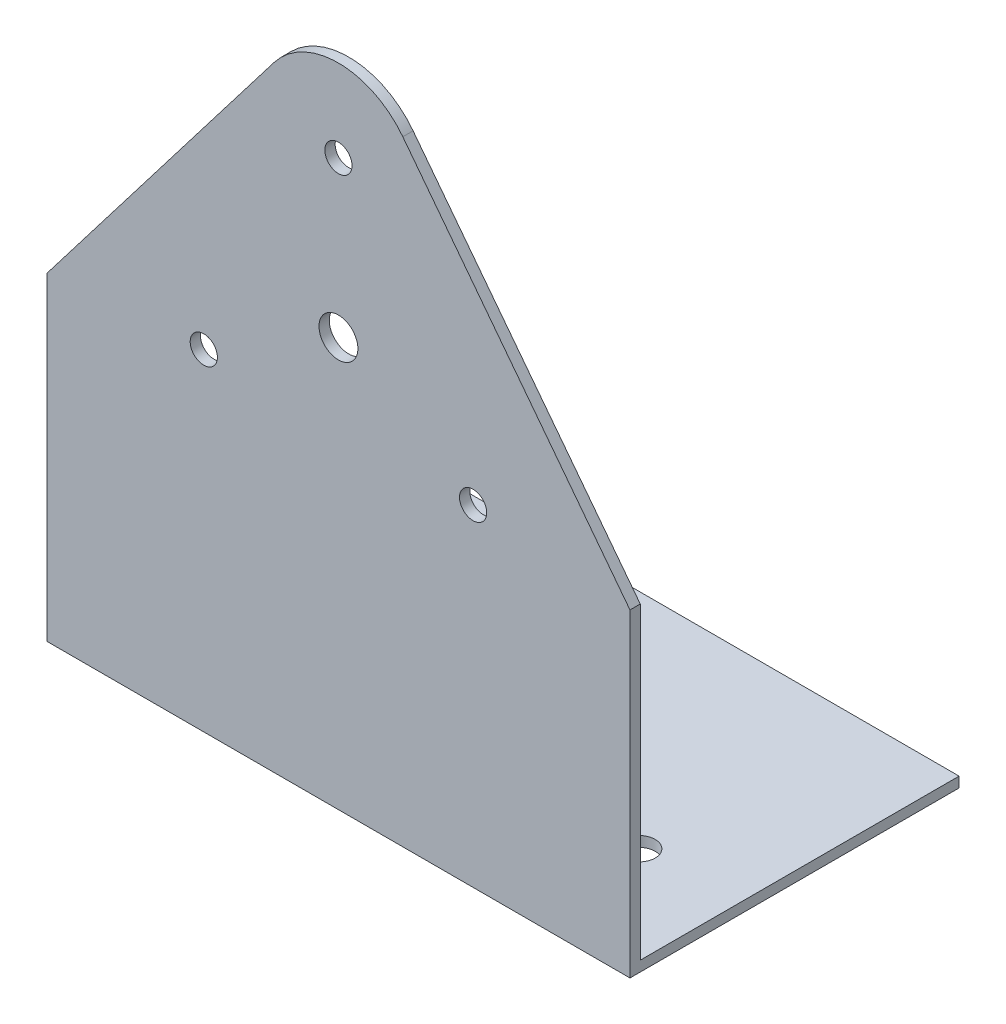
ISO-10303-21;
HEADER;
FILE_DESCRIPTION(('STEP AP214'),'2;1');
FILE_NAME('part.step','',(''),(''),'','','');
FILE_SCHEMA(('AUTOMOTIVE_DESIGN { 1 0 10303 214 1 1 1 1 }'));
ENDSEC;
DATA;
#1=APPLICATION_CONTEXT('core data for automotive mechanical design processes');
#2=APPLICATION_PROTOCOL_DEFINITION('international standard','automotive_design',2000,#1);
#3=PRODUCT_CONTEXT('',#1,'mechanical');
#4=PRODUCT('Part','Part','',(#3));
#5=PRODUCT_RELATED_PRODUCT_CATEGORY('part','',(#4));
#6=PRODUCT_DEFINITION_FORMATION('','',#4);
#7=PRODUCT_DEFINITION_CONTEXT('part definition',#1,'design');
#8=PRODUCT_DEFINITION('design','',#6,#7);
#9=PRODUCT_DEFINITION_SHAPE('','',#8);
#10=(LENGTH_UNIT() NAMED_UNIT(*) SI_UNIT(.MILLI.,.METRE.));
#11=(NAMED_UNIT(*) PLANE_ANGLE_UNIT() SI_UNIT($,.RADIAN.));
#12=(NAMED_UNIT(*) SI_UNIT($,.STERADIAN.) SOLID_ANGLE_UNIT());
#13=UNCERTAINTY_MEASURE_WITH_UNIT(LENGTH_MEASURE(1.E-05),#10,'distance_accuracy_value','');
#14=(GEOMETRIC_REPRESENTATION_CONTEXT(3) GLOBAL_UNCERTAINTY_ASSIGNED_CONTEXT((#13)) GLOBAL_UNIT_ASSIGNED_CONTEXT((#10,
#11,#12)) REPRESENTATION_CONTEXT('',''));
#15=CARTESIAN_POINT('',(0.,0.,0.));
#16=DIRECTION('',(0.,0.,1.));
#17=DIRECTION('',(1.,0.,0.));
#18=AXIS2_PLACEMENT_3D('',#15,#16,#17);
#19=CARTESIAN_POINT('',(90.,0.,0.));
#20=DIRECTION('',(0.,1.,0.));
#21=DIRECTION('',(0.,0.,1.));
#22=AXIS2_PLACEMENT_3D('',#19,#20,#21);
#23=PLANE('',#22);
#24=CARTESIAN_POINT('',(15.,0.,-16.3875));
#25=DIRECTION('',(0.,-1.,0.));
#26=DIRECTION('',(0.,0.,-1.));
#27=AXIS2_PLACEMENT_3D('',#24,#25,#26);
#28=CIRCLE('',#27,2.5);
#29=CARTESIAN_POINT('',(15.,0.,-18.8875));
#30=VERTEX_POINT('',#29);
#31=EDGE_CURVE('E147',#30,#30,#28,.T.);
#32=ORIENTED_EDGE('',*,*,#31,.F.);
#33=EDGE_LOOP('',(#32));
#34=FACE_BOUND('',#33,.T.);
#35=CARTESIAN_POINT('',(75.,0.,-16.3875));
#36=DIRECTION('',(0.,-1.,0.));
#37=DIRECTION('',(0.,0.,-1.));
#38=AXIS2_PLACEMENT_3D('',#35,#36,#37);
#39=CIRCLE('',#38,2.50000000000001);
#40=CARTESIAN_POINT('',(75.,0.,-18.8875));
#41=VERTEX_POINT('',#40);
#42=EDGE_CURVE('E153',#41,#41,#39,.T.);
#43=ORIENTED_EDGE('',*,*,#42,.F.);
#44=EDGE_LOOP('',(#43));
#45=FACE_BOUND('',#44,.T.);
#46=DIRECTION('',(0.,0.,-1.));
#47=VECTOR('',#46,1.);
#48=CARTESIAN_POINT('',(0.,0.,0.));
#49=LINE('',#48,#47);
#50=CARTESIAN_POINT('',(0.,0.,0.));
#51=VERTEX_POINT('',#50);
#52=CARTESIAN_POINT('',(0.,0.,-50.8));
#53=VERTEX_POINT('',#52);
#54=EDGE_CURVE('E128',#51,#53,#49,.T.);
#55=ORIENTED_EDGE('',*,*,#54,.T.);
#56=DIRECTION('',(-1.,0.,0.));
#57=VECTOR('',#56,1.);
#58=CARTESIAN_POINT('',(90.,0.,-50.8));
#59=LINE('',#58,#57);
#60=CARTESIAN_POINT('',(90.,0.,-50.8));
#61=VERTEX_POINT('',#60);
#62=EDGE_CURVE('E117',#61,#53,#59,.T.);
#63=ORIENTED_EDGE('',*,*,#62,.F.);
#64=DIRECTION('',(0.,0.,-1.));
#65=VECTOR('',#64,1.);
#66=CARTESIAN_POINT('',(90.,0.,0.));
#67=LINE('',#66,#65);
#68=CARTESIAN_POINT('',(90.,0.,0.));
#69=VERTEX_POINT('',#68);
#70=EDGE_CURVE('E129',#69,#61,#67,.T.);
#71=ORIENTED_EDGE('',*,*,#70,.F.);
#72=DIRECTION('',(-1.,0.,0.));
#73=VECTOR('',#72,1.);
#74=CARTESIAN_POINT('',(90.,0.,0.));
#75=LINE('',#74,#73);
#76=EDGE_CURVE('E137',#69,#51,#75,.T.);
#77=ORIENTED_EDGE('',*,*,#76,.T.);
#78=EDGE_LOOP('',(#55,#63,#71,#77));
#79=FACE_BOUND('',#78,.T.);
#80=ADVANCED_FACE('F36',(#34,#45,#79),#23,.F.);
#81=CARTESIAN_POINT('',(90.,0.,-50.8));
#82=DIRECTION('',(0.,0.,1.));
#83=DIRECTION('',(1.,0.,0.));
#84=AXIS2_PLACEMENT_3D('',#81,#82,#83);
#85=PLANE('',#84);
#86=DIRECTION('',(0.,1.,0.));
#87=VECTOR('',#86,1.);
#88=CARTESIAN_POINT('',(0.,0.,-50.8));
#89=LINE('',#88,#87);
#90=CARTESIAN_POINT('',(0.,1.5875,-50.8));
#91=VERTEX_POINT('',#90);
#92=EDGE_CURVE('E204',#53,#91,#89,.T.);
#93=ORIENTED_EDGE('',*,*,#92,.T.);
#94=DIRECTION('',(-1.,0.,0.));
#95=VECTOR('',#94,1.);
#96=CARTESIAN_POINT('',(90.,1.5875,-50.8));
#97=LINE('',#96,#95);
#98=CARTESIAN_POINT('',(90.,1.5875,-50.8));
#99=VERTEX_POINT('',#98);
#100=EDGE_CURVE('E142',#99,#91,#97,.T.);
#101=ORIENTED_EDGE('',*,*,#100,.F.);
#102=DIRECTION('',(0.,1.,0.));
#103=VECTOR('',#102,1.);
#104=CARTESIAN_POINT('',(90.,0.,-50.8));
#105=LINE('',#104,#103);
#106=EDGE_CURVE('E91',#61,#99,#105,.T.);
#107=ORIENTED_EDGE('',*,*,#106,.F.);
#108=ORIENTED_EDGE('',*,*,#62,.T.);
#109=EDGE_LOOP('',(#93,#101,#107,#108));
#110=FACE_BOUND('',#109,.T.);
#111=ADVANCED_FACE('F216',(#110),#85,.F.);
#112=CARTESIAN_POINT('',(90.,1.5875,-1.5875));
#113=DIRECTION('',(0.,-1.,0.));
#114=DIRECTION('',(0.,0.,-1.));
#115=AXIS2_PLACEMENT_3D('',#112,#113,#114);
#116=PLANE('',#115);
#117=CARTESIAN_POINT('',(15.,1.58750000000001,-16.3875));
#118=DIRECTION('',(0.,-1.,0.));
#119=DIRECTION('',(0.,0.,-1.));
#120=AXIS2_PLACEMENT_3D('',#117,#118,#119);
#121=CIRCLE('',#120,2.5);
#122=CARTESIAN_POINT('',(15.,1.58750000000001,-18.8875));
#123=VERTEX_POINT('',#122);
#124=EDGE_CURVE('E39',#123,#123,#121,.T.);
#125=ORIENTED_EDGE('',*,*,#124,.T.);
#126=EDGE_LOOP('',(#125));
#127=FACE_BOUND('',#126,.T.);
#128=CARTESIAN_POINT('',(75.,1.58750000000001,-16.3875));
#129=DIRECTION('',(0.,-1.,0.));
#130=DIRECTION('',(0.,0.,-1.));
#131=AXIS2_PLACEMENT_3D('',#128,#129,#130);
#132=CIRCLE('',#131,2.50000000000001);
#133=CARTESIAN_POINT('',(75.,1.58750000000001,-18.8875));
#134=VERTEX_POINT('',#133);
#135=EDGE_CURVE('E145',#134,#134,#132,.T.);
#136=ORIENTED_EDGE('',*,*,#135,.T.);
#137=EDGE_LOOP('',(#136));
#138=FACE_BOUND('',#137,.T.);
#139=DIRECTION('',(0.,0.,1.));
#140=VECTOR('',#139,1.);
#141=CARTESIAN_POINT('',(0.,1.5875,-1.5875));
#142=LINE('',#141,#140);
#143=CARTESIAN_POINT('',(0.,1.5875,-1.5875));
#144=VERTEX_POINT('',#143);
#145=EDGE_CURVE('E133',#91,#144,#142,.T.);
#146=ORIENTED_EDGE('',*,*,#145,.T.);
#147=DIRECTION('',(-1.,0.,0.));
#148=VECTOR('',#147,1.);
#149=CARTESIAN_POINT('',(90.,1.5875,-1.5875));
#150=LINE('',#149,#148);
#151=CARTESIAN_POINT('',(90.,1.5875,-1.5875));
#152=VERTEX_POINT('',#151);
#153=EDGE_CURVE('E139',#152,#144,#150,.T.);
#154=ORIENTED_EDGE('',*,*,#153,.F.);
#155=DIRECTION('',(0.,0.,1.));
#156=VECTOR('',#155,1.);
#157=CARTESIAN_POINT('',(90.,1.5875,-1.5875));
#158=LINE('',#157,#156);
#159=EDGE_CURVE('E197',#99,#152,#158,.T.);
#160=ORIENTED_EDGE('',*,*,#159,.F.);
#161=ORIENTED_EDGE('',*,*,#100,.T.);
#162=EDGE_LOOP('',(#146,#154,#160,#161));
#163=FACE_BOUND('',#162,.T.);
#164=ADVANCED_FACE('F208',(#127,#138,#163),#116,.F.);
#165=CARTESIAN_POINT('',(90.,1.5875,-1.5875));
#166=DIRECTION('',(0.,0.,1.));
#167=DIRECTION('',(0.,-1.,0.));
#168=AXIS2_PLACEMENT_3D('',#165,#166,#167);
#169=PLANE('',#168);
#170=CARTESIAN_POINT('',(45.,87.1212211943911,-1.5875));
#171=DIRECTION('',(0.,0.,1.));
#172=DIRECTION('',(0.,-1.,0.));
#173=AXIS2_PLACEMENT_3D('',#170,#171,#172);
#174=CIRCLE('',#173,2.1);
#175=CARTESIAN_POINT('',(45.,85.0212211943911,-1.5875));
#176=VERTEX_POINT('',#175);
#177=EDGE_CURVE('E123',#176,#176,#174,.T.);
#178=ORIENTED_EDGE('',*,*,#177,.T.);
#179=EDGE_LOOP('',(#178));
#180=FACE_BOUND('',#179,.T.);
#181=CARTESIAN_POINT('',(45.,63.1212211943911,-1.5875));
#182=DIRECTION('',(0.,0.,1.));
#183=DIRECTION('',(0.,-1.,0.));
#184=AXIS2_PLACEMENT_3D('',#181,#182,#183);
#185=CIRCLE('',#184,3.);
#186=CARTESIAN_POINT('',(45.,60.1212211943911,-1.5875));
#187=VERTEX_POINT('',#186);
#188=EDGE_CURVE('E177',#187,#187,#185,.T.);
#189=ORIENTED_EDGE('',*,*,#188,.T.);
#190=EDGE_LOOP('',(#189));
#191=FACE_BOUND('',#190,.T.);
#192=CARTESIAN_POINT('',(65.7846096908275,51.1212211943916,-1.5875));
#193=DIRECTION('',(0.,0.,1.));
#194=DIRECTION('',(0.,-1.,0.));
#195=AXIS2_PLACEMENT_3D('',#192,#193,#194);
#196=CIRCLE('',#195,2.1);
#197=CARTESIAN_POINT('',(65.7846096908275,49.0212211943916,-1.5875));
#198=VERTEX_POINT('',#197);
#199=EDGE_CURVE('E174',#198,#198,#196,.T.);
#200=ORIENTED_EDGE('',*,*,#199,.T.);
#201=EDGE_LOOP('',(#200));
#202=FACE_BOUND('',#201,.T.);
#203=CARTESIAN_POINT('',(24.2153903091735,51.1212211943911,-1.5875));
#204=DIRECTION('',(0.,0.,1.));
#205=DIRECTION('',(0.,-1.,0.));
#206=AXIS2_PLACEMENT_3D('',#203,#204,#205);
#207=CIRCLE('',#206,2.09999999999909);
#208=CARTESIAN_POINT('',(24.2153903091735,49.021221194392,-1.5875));
#209=VERTEX_POINT('',#208);
#210=EDGE_CURVE('E163',#209,#209,#207,.T.);
#211=ORIENTED_EDGE('',*,*,#210,.T.);
#212=EDGE_LOOP('',(#211));
#213=FACE_BOUND('',#212,.T.);
#214=CARTESIAN_POINT('',(45.,87.3,-1.5875));
#215=DIRECTION('',(0.,0.,1.));
#216=DIRECTION('',(0.,-1.,0.));
#217=AXIS2_PLACEMENT_3D('',#214,#215,#216);
#218=CIRCLE('',#217,12.5212211943911);
#219=CARTESIAN_POINT('',(35.0643782178029,94.92,-1.5875));
#220=VERTEX_POINT('',#219);
#221=CARTESIAN_POINT('',(54.9356217821971,94.92,-1.5875));
#222=VERTEX_POINT('',#221);
#223=EDGE_CURVE('E193',#220,#222,#218,.F.);
#224=ORIENTED_EDGE('',*,*,#223,.T.);
#225=DIRECTION('',(0.608566838785132,-0.793502616713437,0.));
#226=VECTOR('',#225,1.);
#227=CARTESIAN_POINT('',(112.992046683639,19.2209606499669,-1.5875));
#228=LINE('',#227,#226);
#229=CARTESIAN_POINT('',(90.,49.2,-1.5875));
#230=VERTEX_POINT('',#229);
#231=EDGE_CURVE('E190',#222,#230,#228,.T.);
#232=ORIENTED_EDGE('',*,*,#231,.T.);
#233=DIRECTION('',(0.,1.,0.));
#234=VECTOR('',#233,1.);
#235=CARTESIAN_POINT('',(90.,1.5875,-1.5875));
#236=LINE('',#235,#234);
#237=EDGE_CURVE('E199',#152,#230,#236,.T.);
#238=ORIENTED_EDGE('',*,*,#237,.F.);
#239=ORIENTED_EDGE('',*,*,#153,.T.);
#240=DIRECTION('',(0.,1.,0.));
#241=VECTOR('',#240,1.);
#242=CARTESIAN_POINT('',(0.,1.5875,-1.5875));
#243=LINE('',#242,#241);
#244=CARTESIAN_POINT('',(0.,49.2,-1.5875));
#245=VERTEX_POINT('',#244);
#246=EDGE_CURVE('E130',#144,#245,#243,.T.);
#247=ORIENTED_EDGE('',*,*,#246,.T.);
#248=DIRECTION('',(0.608566838785132,0.793502616713437,0.));
#249=VECTOR('',#248,1.);
#250=CARTESIAN_POINT('',(10.339777070565,62.6819047618592,-1.5875));
#251=LINE('',#250,#249);
#252=EDGE_CURVE('E52',#245,#220,#251,.T.);
#253=ORIENTED_EDGE('',*,*,#252,.T.);
#254=EDGE_LOOP('',(#224,#232,#238,#239,#247,#253));
#255=FACE_BOUND('',#254,.T.);
#256=ADVANCED_FACE('F212',(#180,#191,#202,#213,#255),#169,.F.);
#257=CARTESIAN_POINT('',(90.,0.,0.));
#258=DIRECTION('',(0.,0.,-1.));
#259=DIRECTION('',(-1.,0.,0.));
#260=AXIS2_PLACEMENT_3D('',#257,#258,#259);
#261=PLANE('',#260);
#262=CARTESIAN_POINT('',(45.,87.1212211943911,0.));
#263=DIRECTION('',(0.,0.,1.));
#264=DIRECTION('',(1.,0.,0.));
#265=AXIS2_PLACEMENT_3D('',#262,#263,#264);
#266=CIRCLE('',#265,2.1);
#267=CARTESIAN_POINT('',(47.1,87.1212211943911,0.));
#268=VERTEX_POINT('',#267);
#269=EDGE_CURVE('E160',#268,#268,#266,.T.);
#270=ORIENTED_EDGE('',*,*,#269,.F.);
#271=EDGE_LOOP('',(#270));
#272=FACE_BOUND('',#271,.T.);
#273=CARTESIAN_POINT('',(45.,63.1212211943911,0.));
#274=DIRECTION('',(0.,0.,1.));
#275=DIRECTION('',(1.,0.,0.));
#276=AXIS2_PLACEMENT_3D('',#273,#274,#275);
#277=CIRCLE('',#276,3.);
#278=CARTESIAN_POINT('',(48.,63.1212211943911,0.));
#279=VERTEX_POINT('',#278);
#280=EDGE_CURVE('E164',#279,#279,#277,.T.);
#281=ORIENTED_EDGE('',*,*,#280,.F.);
#282=EDGE_LOOP('',(#281));
#283=FACE_BOUND('',#282,.T.);
#284=CARTESIAN_POINT('',(65.7846096908275,51.1212211943916,0.));
#285=DIRECTION('',(0.,0.,1.));
#286=DIRECTION('',(1.,0.,0.));
#287=AXIS2_PLACEMENT_3D('',#284,#285,#286);
#288=CIRCLE('',#287,2.1);
#289=CARTESIAN_POINT('',(67.8846096908275,51.1212211943916,0.));
#290=VERTEX_POINT('',#289);
#291=EDGE_CURVE('E167',#290,#290,#288,.T.);
#292=ORIENTED_EDGE('',*,*,#291,.F.);
#293=EDGE_LOOP('',(#292));
#294=FACE_BOUND('',#293,.T.);
#295=CARTESIAN_POINT('',(24.2153903091735,51.1212211943911,0.));
#296=DIRECTION('',(0.,0.,1.));
#297=DIRECTION('',(1.,0.,0.));
#298=AXIS2_PLACEMENT_3D('',#295,#296,#297);
#299=CIRCLE('',#298,2.09999999999909);
#300=CARTESIAN_POINT('',(26.3153903091726,51.1212211943911,0.));
#301=VERTEX_POINT('',#300);
#302=EDGE_CURVE('E151',#301,#301,#299,.T.);
#303=ORIENTED_EDGE('',*,*,#302,.F.);
#304=EDGE_LOOP('',(#303));
#305=FACE_BOUND('',#304,.T.);
#306=DIRECTION('',(0.,-1.,0.));
#307=VECTOR('',#306,1.);
#308=CARTESIAN_POINT('',(90.,0.,0.));
#309=LINE('',#308,#307);
#310=CARTESIAN_POINT('',(90.,49.2,0.));
#311=VERTEX_POINT('',#310);
#312=EDGE_CURVE('E61',#311,#69,#309,.T.);
#313=ORIENTED_EDGE('',*,*,#312,.F.);
#314=DIRECTION('',(0.608566838785132,-0.793502616713437,0.));
#315=VECTOR('',#314,1.);
#316=CARTESIAN_POINT('',(54.9356217821971,94.92,0.));
#317=LINE('',#316,#315);
#318=CARTESIAN_POINT('',(54.9356217821971,94.92,0.));
#319=VERTEX_POINT('',#318);
#320=EDGE_CURVE('E183',#319,#311,#317,.T.);
#321=ORIENTED_EDGE('',*,*,#320,.F.);
#322=CARTESIAN_POINT('',(45.,87.3,0.));
#323=DIRECTION('',(0.,0.,-1.));
#324=DIRECTION('',(1.,0.,0.));
#325=AXIS2_PLACEMENT_3D('',#322,#323,#324);
#326=CIRCLE('',#325,12.5212211943911);
#327=CARTESIAN_POINT('',(35.0643782178029,94.92,0.));
#328=VERTEX_POINT('',#327);
#329=EDGE_CURVE('E122',#328,#319,#326,.T.);
#330=ORIENTED_EDGE('',*,*,#329,.F.);
#331=DIRECTION('',(0.608566838785132,0.793502616713437,0.));
#332=VECTOR('',#331,1.);
#333=CARTESIAN_POINT('',(35.0643782178029,94.92,0.));
#334=LINE('',#333,#332);
#335=CARTESIAN_POINT('',(0.,49.2,0.));
#336=VERTEX_POINT('',#335);
#337=EDGE_CURVE('E112',#336,#328,#334,.T.);
#338=ORIENTED_EDGE('',*,*,#337,.F.);
#339=DIRECTION('',(0.,-1.,0.));
#340=VECTOR('',#339,1.);
#341=CARTESIAN_POINT('',(0.,0.,0.));
#342=LINE('',#341,#340);
#343=EDGE_CURVE('E83',#336,#51,#342,.T.);
#344=ORIENTED_EDGE('',*,*,#343,.T.);
#345=ORIENTED_EDGE('',*,*,#76,.F.);
#346=EDGE_LOOP('',(#313,#321,#330,#338,#344,#345));
#347=FACE_BOUND('',#346,.T.);
#348=ADVANCED_FACE('F119',(#272,#283,#294,#305,#347),#261,.F.);
#349=CARTESIAN_POINT('',(90.,0.,0.));
#350=DIRECTION('',(1.,0.,0.));
#351=DIRECTION('',(0.,0.,-1.));
#352=AXIS2_PLACEMENT_3D('',#349,#350,#351);
#353=PLANE('',#352);
#354=DIRECTION('',(0.,0.,-1.));
#355=VECTOR('',#354,1.);
#356=CARTESIAN_POINT('',(90.,49.2,0.));
#357=LINE('',#356,#355);
#358=EDGE_CURVE('E11',#311,#230,#357,.T.);
#359=ORIENTED_EDGE('',*,*,#358,.F.);
#360=ORIENTED_EDGE('',*,*,#312,.T.);
#361=ORIENTED_EDGE('',*,*,#70,.T.);
#362=ORIENTED_EDGE('',*,*,#106,.T.);
#363=ORIENTED_EDGE('',*,*,#159,.T.);
#364=ORIENTED_EDGE('',*,*,#237,.T.);
#365=EDGE_LOOP('',(#359,#360,#361,#362,#363,#364));
#366=FACE_BOUND('',#365,.T.);
#367=ADVANCED_FACE('F213',(#366),#353,.T.);
#368=CARTESIAN_POINT('',(0.,0.,0.));
#369=DIRECTION('',(1.,0.,0.));
#370=DIRECTION('',(0.,0.,-1.));
#371=AXIS2_PLACEMENT_3D('',#368,#369,#370);
#372=PLANE('',#371);
#373=ORIENTED_EDGE('',*,*,#343,.F.);
#374=DIRECTION('',(0.,0.,-1.));
#375=VECTOR('',#374,1.);
#376=CARTESIAN_POINT('',(0.,49.2,0.));
#377=LINE('',#376,#375);
#378=EDGE_CURVE('E44',#336,#245,#377,.T.);
#379=ORIENTED_EDGE('',*,*,#378,.T.);
#380=ORIENTED_EDGE('',*,*,#246,.F.);
#381=ORIENTED_EDGE('',*,*,#145,.F.);
#382=ORIENTED_EDGE('',*,*,#92,.F.);
#383=ORIENTED_EDGE('',*,*,#54,.F.);
#384=EDGE_LOOP('',(#373,#379,#380,#381,#382,#383));
#385=FACE_BOUND('',#384,.T.);
#386=ADVANCED_FACE('F126',(#385),#372,.F.);
#387=CARTESIAN_POINT('',(45.,87.3,-50.8));
#388=DIRECTION('',(0.,0.,1.));
#389=DIRECTION('',(1.,0.,0.));
#390=AXIS2_PLACEMENT_3D('',#387,#388,#389);
#391=CYLINDRICAL_SURFACE('',#390,12.5212211943911);
#392=DIRECTION('',(0.,0.,1.));
#393=VECTOR('',#392,1.);
#394=CARTESIAN_POINT('',(35.0643782178029,94.92,-50.8));
#395=LINE('',#394,#393);
#396=EDGE_CURVE('E185',#220,#328,#395,.T.);
#397=ORIENTED_EDGE('',*,*,#396,.T.);
#398=ORIENTED_EDGE('',*,*,#329,.T.);
#399=DIRECTION('',(0.,0.,1.));
#400=VECTOR('',#399,1.);
#401=CARTESIAN_POINT('',(54.9356217821971,94.92,-50.8));
#402=LINE('',#401,#400);
#403=EDGE_CURVE('E186',#222,#319,#402,.T.);
#404=ORIENTED_EDGE('',*,*,#403,.F.);
#405=ORIENTED_EDGE('',*,*,#223,.F.);
#406=EDGE_LOOP('',(#397,#398,#404,#405));
#407=FACE_BOUND('',#406,.T.);
#408=ADVANCED_FACE('F222',(#407),#391,.T.);
#409=CARTESIAN_POINT('',(54.9356217821971,94.92,-50.8));
#410=DIRECTION('',(-0.793502616713437,-0.608566838785132,0.));
#411=DIRECTION('',(0.608566838785132,-0.793502616713437,0.));
#412=AXIS2_PLACEMENT_3D('',#409,#410,#411);
#413=PLANE('',#412);
#414=ORIENTED_EDGE('',*,*,#403,.T.);
#415=ORIENTED_EDGE('',*,*,#320,.T.);
#416=ORIENTED_EDGE('',*,*,#358,.T.);
#417=ORIENTED_EDGE('',*,*,#231,.F.);
#418=EDGE_LOOP('',(#414,#415,#416,#417));
#419=FACE_BOUND('',#418,.T.);
#420=ADVANCED_FACE('F219',(#419),#413,.F.);
#421=CARTESIAN_POINT('',(35.0643782178029,94.92,-50.8));
#422=DIRECTION('',(0.793502616713437,-0.608566838785132,0.));
#423=DIRECTION('',(0.608566838785132,0.793502616713437,0.));
#424=AXIS2_PLACEMENT_3D('',#421,#422,#423);
#425=PLANE('',#424);
#426=ORIENTED_EDGE('',*,*,#378,.F.);
#427=ORIENTED_EDGE('',*,*,#337,.T.);
#428=ORIENTED_EDGE('',*,*,#396,.F.);
#429=ORIENTED_EDGE('',*,*,#252,.F.);
#430=EDGE_LOOP('',(#426,#427,#428,#429));
#431=FACE_BOUND('',#430,.T.);
#432=ADVANCED_FACE('F111',(#431),#425,.F.);
#433=CARTESIAN_POINT('',(24.2153903091735,51.1212211943911,-50.8));
#434=DIRECTION('',(0.,0.,1.));
#435=DIRECTION('',(1.,0.,0.));
#436=AXIS2_PLACEMENT_3D('',#433,#434,#435);
#437=CYLINDRICAL_SURFACE('',#436,2.09999999999909);
#438=ORIENTED_EDGE('',*,*,#302,.T.);
#439=EDGE_LOOP('',(#438));
#440=FACE_BOUND('',#439,.T.);
#441=ORIENTED_EDGE('',*,*,#210,.F.);
#442=EDGE_LOOP('',(#441));
#443=FACE_BOUND('',#442,.T.);
#444=ADVANCED_FACE('F261',(#440,#443),#437,.F.);
#445=CARTESIAN_POINT('',(65.7846096908275,51.1212211943916,-50.8));
#446=DIRECTION('',(0.,0.,1.));
#447=DIRECTION('',(1.,0.,0.));
#448=AXIS2_PLACEMENT_3D('',#445,#446,#447);
#449=CYLINDRICAL_SURFACE('',#448,2.1);
#450=ORIENTED_EDGE('',*,*,#291,.T.);
#451=EDGE_LOOP('',(#450));
#452=FACE_BOUND('',#451,.T.);
#453=ORIENTED_EDGE('',*,*,#199,.F.);
#454=EDGE_LOOP('',(#453));
#455=FACE_BOUND('',#454,.T.);
#456=ADVANCED_FACE('F257',(#452,#455),#449,.F.);
#457=CARTESIAN_POINT('',(45.,63.1212211943911,-50.8));
#458=DIRECTION('',(0.,0.,1.));
#459=DIRECTION('',(1.,0.,0.));
#460=AXIS2_PLACEMENT_3D('',#457,#458,#459);
#461=CYLINDRICAL_SURFACE('',#460,3.);
#462=ORIENTED_EDGE('',*,*,#280,.T.);
#463=EDGE_LOOP('',(#462));
#464=FACE_BOUND('',#463,.T.);
#465=ORIENTED_EDGE('',*,*,#188,.F.);
#466=EDGE_LOOP('',(#465));
#467=FACE_BOUND('',#466,.T.);
#468=ADVANCED_FACE('F251',(#464,#467),#461,.F.);
#469=CARTESIAN_POINT('',(45.,87.1212211943911,-50.8));
#470=DIRECTION('',(0.,0.,1.));
#471=DIRECTION('',(1.,0.,0.));
#472=AXIS2_PLACEMENT_3D('',#469,#470,#471);
#473=CYLINDRICAL_SURFACE('',#472,2.1);
#474=ORIENTED_EDGE('',*,*,#269,.T.);
#475=EDGE_LOOP('',(#474));
#476=FACE_BOUND('',#475,.T.);
#477=ORIENTED_EDGE('',*,*,#177,.F.);
#478=EDGE_LOOP('',(#477));
#479=FACE_BOUND('',#478,.T.);
#480=ADVANCED_FACE('F244',(#476,#479),#473,.F.);
#481=CARTESIAN_POINT('',(75.,99.8212211943911,-16.3875));
#482=DIRECTION('',(0.,-1.,0.));
#483=DIRECTION('',(0.,0.,-1.));
#484=AXIS2_PLACEMENT_3D('',#481,#482,#483);
#485=CYLINDRICAL_SURFACE('',#484,2.50000000000001);
#486=ORIENTED_EDGE('',*,*,#42,.T.);
#487=EDGE_LOOP('',(#486));
#488=FACE_BOUND('',#487,.T.);
#489=ORIENTED_EDGE('',*,*,#135,.F.);
#490=EDGE_LOOP('',(#489));
#491=FACE_BOUND('',#490,.T.);
#492=ADVANCED_FACE('F240',(#488,#491),#485,.F.);
#493=CARTESIAN_POINT('',(15.,99.8212211943911,-16.3875));
#494=DIRECTION('',(0.,-1.,0.));
#495=DIRECTION('',(0.,0.,-1.));
#496=AXIS2_PLACEMENT_3D('',#493,#494,#495);
#497=CYLINDRICAL_SURFACE('',#496,2.5);
#498=ORIENTED_EDGE('',*,*,#31,.T.);
#499=EDGE_LOOP('',(#498));
#500=FACE_BOUND('',#499,.T.);
#501=ORIENTED_EDGE('',*,*,#124,.F.);
#502=EDGE_LOOP('',(#501));
#503=FACE_BOUND('',#502,.T.);
#504=ADVANCED_FACE('F243',(#500,#503),#497,.F.);
#505=CLOSED_SHELL('',(#80,#111,#164,#256,#348,#367,#386,#408,#420,#432,#444,#456,#468,#480,#492,#504));
#506=MANIFOLD_SOLID_BREP('B2',#505);
#507=ADVANCED_BREP_SHAPE_REPRESENTATION('',(#18,#506),#14);
#508=SHAPE_DEFINITION_REPRESENTATION(#9,#507);
ENDSEC;
END-ISO-10303-21;
